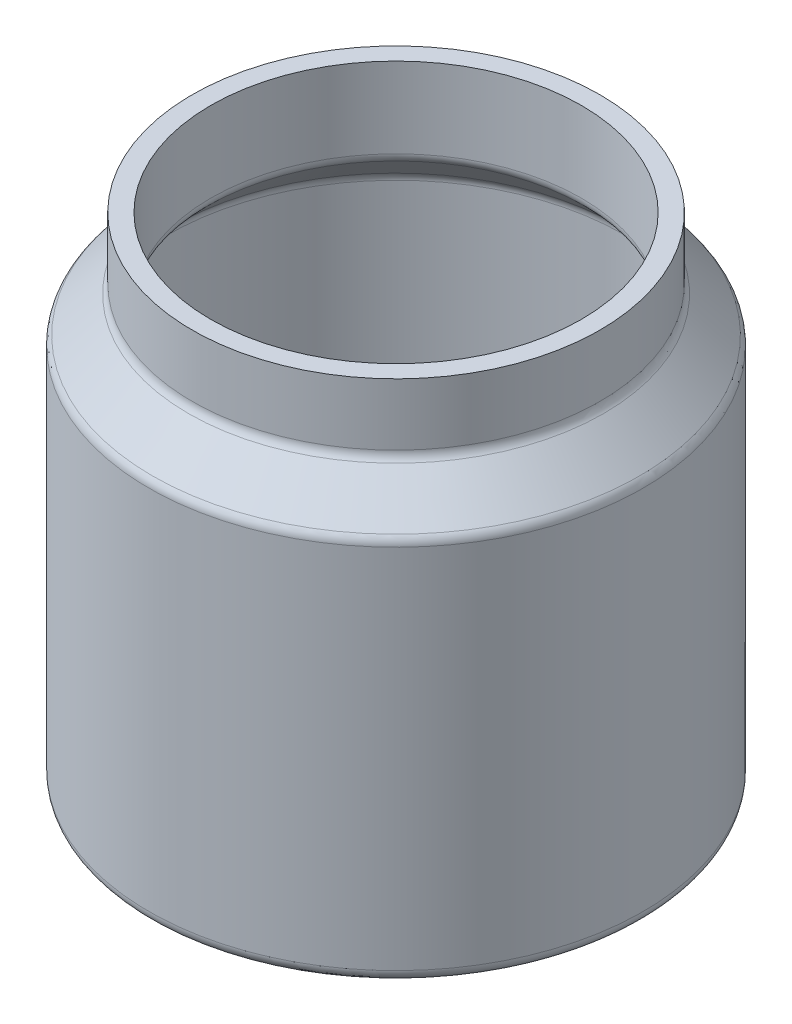
ISO-10303-21;
HEADER;
FILE_DESCRIPTION(('STEP AP214'),'2;1');
FILE_NAME('part.step','',(''),(''),'','','');
FILE_SCHEMA(('AUTOMOTIVE_DESIGN { 1 0 10303 214 1 1 1 1 }'));
ENDSEC;
DATA;
#1=APPLICATION_CONTEXT('core data for automotive mechanical design processes');
#2=APPLICATION_PROTOCOL_DEFINITION('international standard','automotive_design',2000,#1);
#3=PRODUCT_CONTEXT('',#1,'mechanical');
#4=PRODUCT('Part','Part','',(#3));
#5=PRODUCT_RELATED_PRODUCT_CATEGORY('part','',(#4));
#6=PRODUCT_DEFINITION_FORMATION('','',#4);
#7=PRODUCT_DEFINITION_CONTEXT('part definition',#1,'design');
#8=PRODUCT_DEFINITION('design','',#6,#7);
#9=PRODUCT_DEFINITION_SHAPE('','',#8);
#10=(LENGTH_UNIT() NAMED_UNIT(*) SI_UNIT(.MILLI.,.METRE.));
#11=(NAMED_UNIT(*) PLANE_ANGLE_UNIT() SI_UNIT($,.RADIAN.));
#12=(NAMED_UNIT(*) SI_UNIT($,.STERADIAN.) SOLID_ANGLE_UNIT());
#13=UNCERTAINTY_MEASURE_WITH_UNIT(LENGTH_MEASURE(1.E-05),#10,'distance_accuracy_value','');
#14=(GEOMETRIC_REPRESENTATION_CONTEXT(3) GLOBAL_UNCERTAINTY_ASSIGNED_CONTEXT((#13)) GLOBAL_UNIT_ASSIGNED_CONTEXT((#10,
#11,#12)) REPRESENTATION_CONTEXT('',''));
#15=CARTESIAN_POINT('',(0.,0.,0.));
#16=DIRECTION('',(0.,0.,1.));
#17=DIRECTION('',(1.,0.,0.));
#18=AXIS2_PLACEMENT_3D('',#15,#16,#17);
#19=CARTESIAN_POINT('',(0.,0.,0.));
#20=DIRECTION('',(0.,-1.,0.));
#21=DIRECTION('',(0.,0.,-1.));
#22=AXIS2_PLACEMENT_3D('',#19,#20,#21);
#23=PLANE('',#22);
#24=CARTESIAN_POINT('',(0.,0.,0.));
#25=DIRECTION('',(0.,-1.,0.));
#26=DIRECTION('',(0.,0.,-1.));
#27=AXIS2_PLACEMENT_3D('',#24,#25,#26);
#28=CIRCLE('',#27,38.);
#29=CARTESIAN_POINT('',(0.,0.,-38.));
#30=VERTEX_POINT('',#29);
#31=EDGE_CURVE('E10',#30,#30,#28,.T.);
#32=ORIENTED_EDGE('',*,*,#31,.T.);
#33=EDGE_LOOP('',(#32));
#34=FACE_BOUND('',#33,.T.);
#35=ADVANCED_FACE('F28',(#34),#23,.T.);
#36=CARTESIAN_POINT('',(0.,2.,0.));
#37=DIRECTION('',(0.,-1.,0.));
#38=DIRECTION('',(0.,0.,-1.));
#39=AXIS2_PLACEMENT_3D('',#36,#37,#38);
#40=TOROIDAL_SURFACE('',#39,38.,2.);
#41=CARTESIAN_POINT('',(0.,2.,0.));
#42=DIRECTION('',(0.,-1.,0.));
#43=DIRECTION('',(0.,0.,-1.));
#44=AXIS2_PLACEMENT_3D('',#41,#42,#43);
#45=CIRCLE('',#44,40.);
#46=CARTESIAN_POINT('',(0.,2.,-40.));
#47=VERTEX_POINT('',#46);
#48=EDGE_CURVE('E34',#47,#47,#45,.T.);
#49=ORIENTED_EDGE('',*,*,#48,.T.);
#50=EDGE_LOOP('',(#49));
#51=FACE_BOUND('',#50,.T.);
#52=ORIENTED_EDGE('',*,*,#31,.F.);
#53=EDGE_LOOP('',(#52));
#54=FACE_BOUND('',#53,.T.);
#55=ADVANCED_FACE('F90',(#51,#54),#40,.T.);
#56=CARTESIAN_POINT('',(0.,0.,0.));
#57=DIRECTION('',(0.,-1.,0.));
#58=DIRECTION('',(0.,0.,-1.));
#59=AXIS2_PLACEMENT_3D('',#56,#57,#58);
#60=CYLINDRICAL_SURFACE('',#59,40.);
#61=CARTESIAN_POINT('',(0.,61.3431457505076,0.));
#62=DIRECTION('',(0.,-1.,0.));
#63=DIRECTION('',(0.,0.,-1.));
#64=AXIS2_PLACEMENT_3D('',#61,#62,#63);
#65=CIRCLE('',#64,40.);
#66=CARTESIAN_POINT('',(0.,61.3431457505076,-40.));
#67=VERTEX_POINT('',#66);
#68=EDGE_CURVE('E38',#67,#67,#65,.T.);
#69=ORIENTED_EDGE('',*,*,#68,.T.);
#70=EDGE_LOOP('',(#69));
#71=FACE_BOUND('',#70,.T.);
#72=ORIENTED_EDGE('',*,*,#48,.F.);
#73=EDGE_LOOP('',(#72));
#74=FACE_BOUND('',#73,.T.);
#75=ADVANCED_FACE('F94',(#71,#74),#60,.T.);
#76=CARTESIAN_POINT('',(0.,61.3431457505076,0.));
#77=DIRECTION('',(0.,-1.,0.));
#78=DIRECTION('',(0.,0.,-1.));
#79=AXIS2_PLACEMENT_3D('',#76,#77,#78);
#80=TOROIDAL_SURFACE('',#79,38.,1.99999999999999);
#81=CARTESIAN_POINT('',(0.,62.7573593128807,0.));
#82=DIRECTION('',(0.,-1.,0.));
#83=DIRECTION('',(0.,0.,-1.));
#84=AXIS2_PLACEMENT_3D('',#81,#82,#83);
#85=CIRCLE('',#84,39.4142135623731);
#86=CARTESIAN_POINT('',(0.,62.7573593128807,-39.4142135623731));
#87=VERTEX_POINT('',#86);
#88=EDGE_CURVE('E42',#87,#87,#85,.T.);
#89=ORIENTED_EDGE('',*,*,#88,.T.);
#90=EDGE_LOOP('',(#89));
#91=FACE_BOUND('',#90,.T.);
#92=ORIENTED_EDGE('',*,*,#68,.F.);
#93=EDGE_LOOP('',(#92));
#94=FACE_BOUND('',#93,.T.);
#95=ADVANCED_FACE('F98',(#91,#94),#80,.T.);
#96=CARTESIAN_POINT('',(0.,62.7573593128807,0.));
#97=DIRECTION('',(0.,-1.,0.));
#98=DIRECTION('',(0.,0.,-1.));
#99=AXIS2_PLACEMENT_3D('',#96,#97,#98);
#100=CONICAL_SURFACE('',#99,39.4142135623731,0.78539816339745);
#101=CARTESIAN_POINT('',(0.,68.5857864376269,0.));
#102=DIRECTION('',(0.,-1.,0.));
#103=DIRECTION('',(0.,0.,-1.));
#104=AXIS2_PLACEMENT_3D('',#101,#102,#103);
#105=CIRCLE('',#104,33.5857864376269);
#106=CARTESIAN_POINT('',(0.,68.5857864376269,-33.5857864376269));
#107=VERTEX_POINT('',#106);
#108=EDGE_CURVE('E47',#107,#107,#105,.T.);
#109=ORIENTED_EDGE('',*,*,#108,.T.);
#110=EDGE_LOOP('',(#109));
#111=FACE_BOUND('',#110,.T.);
#112=ORIENTED_EDGE('',*,*,#88,.F.);
#113=EDGE_LOOP('',(#112));
#114=FACE_BOUND('',#113,.T.);
#115=ADVANCED_FACE('F105',(#111,#114),#100,.T.);
#116=CARTESIAN_POINT('',(0.,70.,0.));
#117=DIRECTION('',(0.,-1.,0.));
#118=DIRECTION('',(0.,0.,-1.));
#119=AXIS2_PLACEMENT_3D('',#116,#117,#118);
#120=TOROIDAL_SURFACE('',#119,35.,2.);
#121=CARTESIAN_POINT('',(0.,70.,0.));
#122=DIRECTION('',(0.,-1.,0.));
#123=DIRECTION('',(0.,0.,-1.));
#124=AXIS2_PLACEMENT_3D('',#121,#122,#123);
#125=CIRCLE('',#124,33.);
#126=CARTESIAN_POINT('',(0.,70.,-33.));
#127=VERTEX_POINT('',#126);
#128=EDGE_CURVE('E50',#127,#127,#125,.T.);
#129=ORIENTED_EDGE('',*,*,#128,.T.);
#130=EDGE_LOOP('',(#129));
#131=FACE_BOUND('',#130,.T.);
#132=ORIENTED_EDGE('',*,*,#108,.F.);
#133=EDGE_LOOP('',(#132));
#134=FACE_BOUND('',#133,.T.);
#135=ADVANCED_FACE('F109',(#131,#134),#120,.F.);
#136=CARTESIAN_POINT('',(0.,0.,0.));
#137=DIRECTION('',(0.,-1.,0.));
#138=DIRECTION('',(0.,0.,-1.));
#139=AXIS2_PLACEMENT_3D('',#136,#137,#138);
#140=CYLINDRICAL_SURFACE('',#139,33.);
#141=CARTESIAN_POINT('',(0.,80.,0.));
#142=DIRECTION('',(0.,-1.,0.));
#143=DIRECTION('',(0.,0.,-1.));
#144=AXIS2_PLACEMENT_3D('',#141,#142,#143);
#145=CIRCLE('',#144,33.);
#146=CARTESIAN_POINT('',(0.,80.,-33.));
#147=VERTEX_POINT('',#146);
#148=EDGE_CURVE('E53',#147,#147,#145,.T.);
#149=ORIENTED_EDGE('',*,*,#148,.T.);
#150=EDGE_LOOP('',(#149));
#151=FACE_BOUND('',#150,.T.);
#152=ORIENTED_EDGE('',*,*,#128,.F.);
#153=EDGE_LOOP('',(#152));
#154=FACE_BOUND('',#153,.T.);
#155=ADVANCED_FACE('F113',(#151,#154),#140,.T.);
#156=CARTESIAN_POINT('',(33.,80.,0.));
#157=DIRECTION('',(0.,1.,0.));
#158=DIRECTION('',(0.,0.,1.));
#159=AXIS2_PLACEMENT_3D('',#156,#157,#158);
#160=PLANE('',#159);
#161=CARTESIAN_POINT('',(0.,80.,0.));
#162=DIRECTION('',(0.,-1.,0.));
#163=DIRECTION('',(0.,0.,-1.));
#164=AXIS2_PLACEMENT_3D('',#161,#162,#163);
#165=CIRCLE('',#164,30.);
#166=CARTESIAN_POINT('',(0.,80.,-30.));
#167=VERTEX_POINT('',#166);
#168=EDGE_CURVE('E56',#167,#167,#165,.T.);
#169=ORIENTED_EDGE('',*,*,#168,.T.);
#170=EDGE_LOOP('',(#169));
#171=FACE_BOUND('',#170,.T.);
#172=ORIENTED_EDGE('',*,*,#148,.F.);
#173=EDGE_LOOP('',(#172));
#174=FACE_BOUND('',#173,.T.);
#175=ADVANCED_FACE('F117',(#171,#174),#160,.T.);
#176=CARTESIAN_POINT('',(0.,0.,0.));
#177=DIRECTION('',(0.,-1.,0.));
#178=DIRECTION('',(0.,0.,-1.));
#179=AXIS2_PLACEMENT_3D('',#176,#177,#178);
#180=CYLINDRICAL_SURFACE('',#179,30.);
#181=CARTESIAN_POINT('',(0.,67.,0.));
#182=DIRECTION('',(0.,-1.,0.));
#183=DIRECTION('',(0.,0.,-1.));
#184=AXIS2_PLACEMENT_3D('',#181,#182,#183);
#185=CIRCLE('',#184,30.);
#186=CARTESIAN_POINT('',(0.,67.,-30.));
#187=VERTEX_POINT('',#186);
#188=EDGE_CURVE('E59',#187,#187,#185,.T.);
#189=ORIENTED_EDGE('',*,*,#188,.T.);
#190=EDGE_LOOP('',(#189));
#191=FACE_BOUND('',#190,.T.);
#192=ORIENTED_EDGE('',*,*,#168,.F.);
#193=EDGE_LOOP('',(#192));
#194=FACE_BOUND('',#193,.T.);
#195=ADVANCED_FACE('F121',(#191,#194),#180,.F.);
#196=CARTESIAN_POINT('',(0.,67.,0.));
#197=DIRECTION('',(0.,-1.,0.));
#198=DIRECTION('',(0.,0.,-1.));
#199=AXIS2_PLACEMENT_3D('',#196,#197,#198);
#200=TOROIDAL_SURFACE('',#199,32.,2.);
#201=CARTESIAN_POINT('',(0.,65.5857864376269,0.));
#202=DIRECTION('',(0.,-1.,0.));
#203=DIRECTION('',(0.,0.,-1.));
#204=AXIS2_PLACEMENT_3D('',#201,#202,#203);
#205=CIRCLE('',#204,30.5857864376269);
#206=CARTESIAN_POINT('',(0.,65.5857864376269,-30.5857864376269));
#207=VERTEX_POINT('',#206);
#208=EDGE_CURVE('E62',#207,#207,#205,.T.);
#209=ORIENTED_EDGE('',*,*,#208,.T.);
#210=EDGE_LOOP('',(#209));
#211=FACE_BOUND('',#210,.T.);
#212=ORIENTED_EDGE('',*,*,#188,.F.);
#213=EDGE_LOOP('',(#212));
#214=FACE_BOUND('',#213,.T.);
#215=ADVANCED_FACE('F125',(#211,#214),#200,.T.);
#216=CARTESIAN_POINT('',(0.,65.5857864376269,0.));
#217=DIRECTION('',(0.,-1.,0.));
#218=DIRECTION('',(0.,0.,-1.));
#219=AXIS2_PLACEMENT_3D('',#216,#217,#218);
#220=CONICAL_SURFACE('',#219,30.5857864376269,0.78539816339745);
#221=CARTESIAN_POINT('',(0.,59.7573593128807,0.));
#222=DIRECTION('',(0.,-1.,0.));
#223=DIRECTION('',(0.,0.,-1.));
#224=AXIS2_PLACEMENT_3D('',#221,#222,#223);
#225=CIRCLE('',#224,36.4142135623731);
#226=CARTESIAN_POINT('',(0.,59.7573593128807,-36.4142135623731));
#227=VERTEX_POINT('',#226);
#228=EDGE_CURVE('E65',#227,#227,#225,.T.);
#229=ORIENTED_EDGE('',*,*,#228,.T.);
#230=EDGE_LOOP('',(#229));
#231=FACE_BOUND('',#230,.T.);
#232=ORIENTED_EDGE('',*,*,#208,.F.);
#233=EDGE_LOOP('',(#232));
#234=FACE_BOUND('',#233,.T.);
#235=ADVANCED_FACE('F129',(#231,#234),#220,.F.);
#236=CARTESIAN_POINT('',(0.,58.3431457505076,0.));
#237=DIRECTION('',(0.,-1.,0.));
#238=DIRECTION('',(0.,0.,-1.));
#239=AXIS2_PLACEMENT_3D('',#236,#237,#238);
#240=TOROIDAL_SURFACE('',#239,35.,1.99999999999999);
#241=CARTESIAN_POINT('',(0.,58.3431457505076,0.));
#242=DIRECTION('',(0.,-1.,0.));
#243=DIRECTION('',(0.,0.,-1.));
#244=AXIS2_PLACEMENT_3D('',#241,#242,#243);
#245=CIRCLE('',#244,37.);
#246=CARTESIAN_POINT('',(0.,58.3431457505076,-37.));
#247=VERTEX_POINT('',#246);
#248=EDGE_CURVE('E68',#247,#247,#245,.T.);
#249=ORIENTED_EDGE('',*,*,#248,.T.);
#250=EDGE_LOOP('',(#249));
#251=FACE_BOUND('',#250,.T.);
#252=ORIENTED_EDGE('',*,*,#228,.F.);
#253=EDGE_LOOP('',(#252));
#254=FACE_BOUND('',#253,.T.);
#255=ADVANCED_FACE('F133',(#251,#254),#240,.F.);
#256=CARTESIAN_POINT('',(0.,0.,0.));
#257=DIRECTION('',(0.,-1.,0.));
#258=DIRECTION('',(0.,0.,-1.));
#259=AXIS2_PLACEMENT_3D('',#256,#257,#258);
#260=CYLINDRICAL_SURFACE('',#259,37.);
#261=CARTESIAN_POINT('',(0.,5.,0.));
#262=DIRECTION('',(0.,-1.,0.));
#263=DIRECTION('',(0.,0.,-1.));
#264=AXIS2_PLACEMENT_3D('',#261,#262,#263);
#265=CIRCLE('',#264,37.);
#266=CARTESIAN_POINT('',(0.,5.,-37.));
#267=VERTEX_POINT('',#266);
#268=EDGE_CURVE('E71',#267,#267,#265,.T.);
#269=ORIENTED_EDGE('',*,*,#268,.T.);
#270=EDGE_LOOP('',(#269));
#271=FACE_BOUND('',#270,.T.);
#272=ORIENTED_EDGE('',*,*,#248,.F.);
#273=EDGE_LOOP('',(#272));
#274=FACE_BOUND('',#273,.T.);
#275=ADVANCED_FACE('F87',(#271,#274),#260,.F.);
#276=CARTESIAN_POINT('',(0.,5.,0.));
#277=DIRECTION('',(0.,-1.,0.));
#278=DIRECTION('',(0.,0.,-1.));
#279=AXIS2_PLACEMENT_3D('',#276,#277,#278);
#280=TOROIDAL_SURFACE('',#279,35.,2.);
#281=CARTESIAN_POINT('',(0.,3.,0.));
#282=DIRECTION('',(0.,-1.,0.));
#283=DIRECTION('',(0.,0.,-1.));
#284=AXIS2_PLACEMENT_3D('',#281,#282,#283);
#285=CIRCLE('',#284,35.);
#286=CARTESIAN_POINT('',(0.,3.,-35.));
#287=VERTEX_POINT('',#286);
#288=EDGE_CURVE('E74',#287,#287,#285,.T.);
#289=ORIENTED_EDGE('',*,*,#288,.T.);
#290=EDGE_LOOP('',(#289));
#291=FACE_BOUND('',#290,.T.);
#292=ORIENTED_EDGE('',*,*,#268,.F.);
#293=EDGE_LOOP('',(#292));
#294=FACE_BOUND('',#293,.T.);
#295=ADVANCED_FACE('F78',(#291,#294),#280,.F.);
#296=CARTESIAN_POINT('',(35.,3.,0.));
#297=DIRECTION('',(0.,1.,0.));
#298=DIRECTION('',(0.,0.,1.));
#299=AXIS2_PLACEMENT_3D('',#296,#297,#298);
#300=PLANE('',#299);
#301=ORIENTED_EDGE('',*,*,#288,.F.);
#302=EDGE_LOOP('',(#301));
#303=FACE_BOUND('',#302,.T.);
#304=ADVANCED_FACE('F81',(#303),#300,.T.);
#305=CLOSED_SHELL('',(#35,#55,#75,#95,#115,#135,#155,#175,#195,#215,#235,#255,#275,#295,#304));
#306=MANIFOLD_SOLID_BREP('B2',#305);
#307=ADVANCED_BREP_SHAPE_REPRESENTATION('',(#18,#306),#14);
#308=SHAPE_DEFINITION_REPRESENTATION(#9,#307);
ENDSEC;
END-ISO-10303-21;
